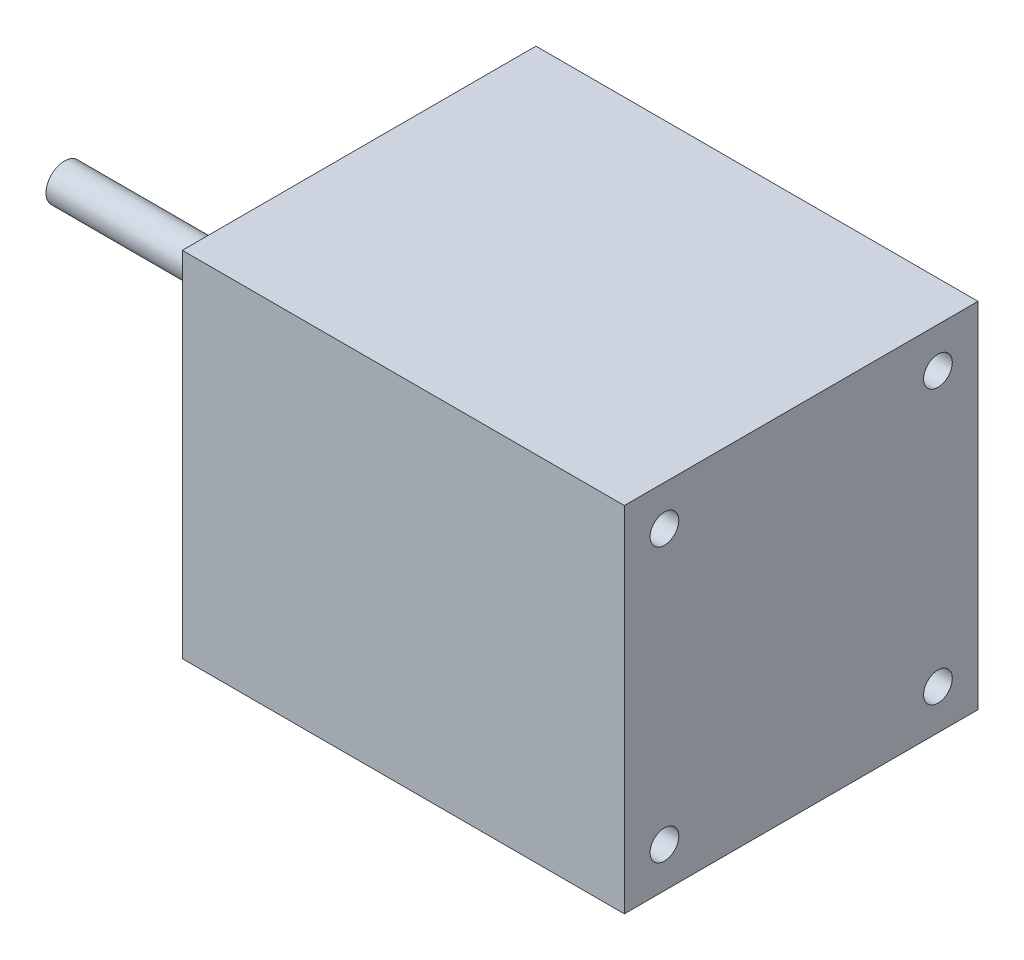
ISO-10303-21;
HEADER;
FILE_DESCRIPTION(('STEP AP214'),'2;1');
FILE_NAME('part.step','',(''),(''),'','','');
FILE_SCHEMA(('AUTOMOTIVE_DESIGN { 1 0 10303 214 1 1 1 1 }'));
ENDSEC;
DATA;
#1=APPLICATION_CONTEXT('core data for automotive mechanical design processes');
#2=APPLICATION_PROTOCOL_DEFINITION('international standard','automotive_design',2000,#1);
#3=PRODUCT_CONTEXT('',#1,'mechanical');
#4=PRODUCT('Part','Part','',(#3));
#5=PRODUCT_RELATED_PRODUCT_CATEGORY('part','',(#4));
#6=PRODUCT_DEFINITION_FORMATION('','',#4);
#7=PRODUCT_DEFINITION_CONTEXT('part definition',#1,'design');
#8=PRODUCT_DEFINITION('design','',#6,#7);
#9=PRODUCT_DEFINITION_SHAPE('','',#8);
#10=(LENGTH_UNIT() NAMED_UNIT(*) SI_UNIT(.MILLI.,.METRE.));
#11=(NAMED_UNIT(*) PLANE_ANGLE_UNIT() SI_UNIT($,.RADIAN.));
#12=(NAMED_UNIT(*) SI_UNIT($,.STERADIAN.) SOLID_ANGLE_UNIT());
#13=UNCERTAINTY_MEASURE_WITH_UNIT(LENGTH_MEASURE(1.E-05),#10,'distance_accuracy_value','');
#14=(GEOMETRIC_REPRESENTATION_CONTEXT(3) GLOBAL_UNCERTAINTY_ASSIGNED_CONTEXT((#13)) GLOBAL_UNIT_ASSIGNED_CONTEXT((#10,
#11,#12)) REPRESENTATION_CONTEXT('',''));
#15=CARTESIAN_POINT('',(0.,0.,0.));
#16=DIRECTION('',(0.,0.,1.));
#17=DIRECTION('',(1.,0.,0.));
#18=AXIS2_PLACEMENT_3D('',#15,#16,#17);
#19=CARTESIAN_POINT('',(76.2,0.,0.));
#20=DIRECTION('',(1.,0.,0.));
#21=DIRECTION('',(0.,0.,-1.));
#22=AXIS2_PLACEMENT_3D('',#19,#20,#21);
#23=PLANE('',#22);
#24=CARTESIAN_POINT('',(76.2,-23.5731723178065,23.5731723178065));
#25=DIRECTION('',(1.,0.,0.));
#26=DIRECTION('',(0.,0.,-1.));
#27=AXIS2_PLACEMENT_3D('',#24,#25,#26);
#28=CIRCLE('',#27,2.4765);
#29=CARTESIAN_POINT('',(76.2,-23.5731723178065,21.0966723178065));
#30=VERTEX_POINT('',#29);
#31=EDGE_CURVE('E231',#30,#30,#28,.T.);
#32=ORIENTED_EDGE('',*,*,#31,.F.);
#33=EDGE_LOOP('',(#32));
#34=FACE_BOUND('',#33,.T.);
#35=CARTESIAN_POINT('',(76.2,23.5731723178065,-23.5731723178065));
#36=DIRECTION('',(1.,0.,0.));
#37=DIRECTION('',(0.,0.,-1.));
#38=AXIS2_PLACEMENT_3D('',#35,#36,#37);
#39=CIRCLE('',#38,2.4765);
#40=CARTESIAN_POINT('',(76.2,23.5731723178065,-26.0496723178065));
#41=VERTEX_POINT('',#40);
#42=EDGE_CURVE('E165',#41,#41,#39,.T.);
#43=ORIENTED_EDGE('',*,*,#42,.F.);
#44=EDGE_LOOP('',(#43));
#45=FACE_BOUND('',#44,.T.);
#46=DIRECTION('',(0.,0.,-1.));
#47=VECTOR('',#46,1.);
#48=CARTESIAN_POINT('',(76.2,-30.48,30.48));
#49=LINE('',#48,#47);
#50=CARTESIAN_POINT('',(76.2,-30.48,30.48));
#51=VERTEX_POINT('',#50);
#52=CARTESIAN_POINT('',(76.2,-30.48,-30.48));
#53=VERTEX_POINT('',#52);
#54=EDGE_CURVE('E147',#51,#53,#49,.T.);
#55=ORIENTED_EDGE('',*,*,#54,.T.);
#56=DIRECTION('',(0.,1.,0.));
#57=VECTOR('',#56,1.);
#58=CARTESIAN_POINT('',(76.2,-30.48,-30.48));
#59=LINE('',#58,#57);
#60=CARTESIAN_POINT('',(76.2,30.48,-30.48));
#61=VERTEX_POINT('',#60);
#62=EDGE_CURVE('E139',#53,#61,#59,.T.);
#63=ORIENTED_EDGE('',*,*,#62,.T.);
#64=DIRECTION('',(0.,0.,-1.));
#65=VECTOR('',#64,1.);
#66=CARTESIAN_POINT('',(76.2,30.48,30.48));
#67=LINE('',#66,#65);
#68=CARTESIAN_POINT('',(76.2,30.48,30.48));
#69=VERTEX_POINT('',#68);
#70=EDGE_CURVE('E146',#69,#61,#67,.T.);
#71=ORIENTED_EDGE('',*,*,#70,.F.);
#72=DIRECTION('',(0.,1.,0.));
#73=VECTOR('',#72,1.);
#74=CARTESIAN_POINT('',(76.2,-30.48,30.48));
#75=LINE('',#74,#73);
#76=EDGE_CURVE('E158',#51,#69,#75,.T.);
#77=ORIENTED_EDGE('',*,*,#76,.F.);
#78=EDGE_LOOP('',(#55,#63,#71,#77));
#79=FACE_BOUND('',#78,.T.);
#80=CARTESIAN_POINT('',(76.2,23.5731723178065,23.5731723178065));
#81=DIRECTION('',(1.,0.,0.));
#82=DIRECTION('',(0.,0.,-1.));
#83=AXIS2_PLACEMENT_3D('',#80,#81,#82);
#84=CIRCLE('',#83,2.4765);
#85=CARTESIAN_POINT('',(76.2,23.5731723178065,21.0966723178065));
#86=VERTEX_POINT('',#85);
#87=EDGE_CURVE('E237',#86,#86,#84,.T.);
#88=ORIENTED_EDGE('',*,*,#87,.F.);
#89=EDGE_LOOP('',(#88));
#90=FACE_BOUND('',#89,.T.);
#91=CARTESIAN_POINT('',(76.2,-23.5731723178065,-23.5731723178065));
#92=DIRECTION('',(1.,0.,0.));
#93=DIRECTION('',(0.,0.,-1.));
#94=AXIS2_PLACEMENT_3D('',#91,#92,#93);
#95=CIRCLE('',#94,2.4765);
#96=CARTESIAN_POINT('',(76.2,-23.5731723178065,-26.0496723178065));
#97=VERTEX_POINT('',#96);
#98=EDGE_CURVE('E225',#97,#97,#95,.T.);
#99=ORIENTED_EDGE('',*,*,#98,.F.);
#100=EDGE_LOOP('',(#99));
#101=FACE_BOUND('',#100,.T.);
#102=ADVANCED_FACE('F96',(#34,#45,#79,#90,#101),#23,.T.);
#103=CARTESIAN_POINT('',(0.,0.,0.));
#104=DIRECTION('',(1.,0.,0.));
#105=DIRECTION('',(0.,0.,-1.));
#106=AXIS2_PLACEMENT_3D('',#103,#104,#105);
#107=PLANE('',#106);
#108=CARTESIAN_POINT('',(0.,0.,0.));
#109=DIRECTION('',(1.,0.,0.));
#110=DIRECTION('',(0.,0.,-1.));
#111=AXIS2_PLACEMENT_3D('',#108,#109,#110);
#112=CIRCLE('',#111,3.175);
#113=CARTESIAN_POINT('',(0.,0.,-3.175));
#114=VERTEX_POINT('',#113);
#115=EDGE_CURVE('E12',#114,#114,#112,.F.);
#116=ORIENTED_EDGE('',*,*,#115,.F.);
#117=EDGE_LOOP('',(#116));
#118=FACE_BOUND('',#117,.T.);
#119=DIRECTION('',(0.,0.,-1.));
#120=VECTOR('',#119,1.);
#121=CARTESIAN_POINT('',(0.,-30.48,30.48));
#122=LINE('',#121,#120);
#123=CARTESIAN_POINT('',(0.,-30.48,30.48));
#124=VERTEX_POINT('',#123);
#125=CARTESIAN_POINT('',(0.,-30.48,-30.48));
#126=VERTEX_POINT('',#125);
#127=EDGE_CURVE('E163',#124,#126,#122,.T.);
#128=ORIENTED_EDGE('',*,*,#127,.F.);
#129=DIRECTION('',(0.,1.,0.));
#130=VECTOR('',#129,1.);
#131=CARTESIAN_POINT('',(0.,-30.48,30.48));
#132=LINE('',#131,#130);
#133=CARTESIAN_POINT('',(0.,30.48,30.48));
#134=VERTEX_POINT('',#133);
#135=EDGE_CURVE('E169',#124,#134,#132,.T.);
#136=ORIENTED_EDGE('',*,*,#135,.T.);
#137=DIRECTION('',(0.,0.,-1.));
#138=VECTOR('',#137,1.);
#139=CARTESIAN_POINT('',(0.,30.48,30.48));
#140=LINE('',#139,#138);
#141=CARTESIAN_POINT('',(0.,30.48,-30.48));
#142=VERTEX_POINT('',#141);
#143=EDGE_CURVE('E167',#134,#142,#140,.T.);
#144=ORIENTED_EDGE('',*,*,#143,.T.);
#145=DIRECTION('',(0.,1.,0.));
#146=VECTOR('',#145,1.);
#147=CARTESIAN_POINT('',(0.,-30.48,-30.48));
#148=LINE('',#147,#146);
#149=EDGE_CURVE('E153',#126,#142,#148,.T.);
#150=ORIENTED_EDGE('',*,*,#149,.F.);
#151=EDGE_LOOP('',(#128,#136,#144,#150));
#152=FACE_BOUND('',#151,.T.);
#153=CARTESIAN_POINT('',(0.,23.5731723178065,-23.5731723178065));
#154=DIRECTION('',(1.,0.,0.));
#155=DIRECTION('',(0.,0.,-1.));
#156=AXIS2_PLACEMENT_3D('',#153,#154,#155);
#157=CIRCLE('',#156,2.4765);
#158=CARTESIAN_POINT('',(0.,23.5731723178065,-26.0496723178065));
#159=VERTEX_POINT('',#158);
#160=EDGE_CURVE('E240',#159,#159,#157,.T.);
#161=ORIENTED_EDGE('',*,*,#160,.T.);
#162=EDGE_LOOP('',(#161));
#163=FACE_BOUND('',#162,.T.);
#164=CARTESIAN_POINT('',(0.,23.5731723178065,23.5731723178065));
#165=DIRECTION('',(1.,0.,0.));
#166=DIRECTION('',(0.,0.,-1.));
#167=AXIS2_PLACEMENT_3D('',#164,#165,#166);
#168=CIRCLE('',#167,2.4765);
#169=CARTESIAN_POINT('',(0.,23.5731723178065,21.0966723178065));
#170=VERTEX_POINT('',#169);
#171=EDGE_CURVE('E234',#170,#170,#168,.T.);
#172=ORIENTED_EDGE('',*,*,#171,.T.);
#173=EDGE_LOOP('',(#172));
#174=FACE_BOUND('',#173,.T.);
#175=CARTESIAN_POINT('',(0.,-23.5731723178065,23.5731723178065));
#176=DIRECTION('',(1.,0.,0.));
#177=DIRECTION('',(0.,0.,-1.));
#178=AXIS2_PLACEMENT_3D('',#175,#176,#177);
#179=CIRCLE('',#178,2.4765);
#180=CARTESIAN_POINT('',(0.,-23.5731723178065,21.0966723178065));
#181=VERTEX_POINT('',#180);
#182=EDGE_CURVE('E229',#181,#181,#179,.T.);
#183=ORIENTED_EDGE('',*,*,#182,.T.);
#184=EDGE_LOOP('',(#183));
#185=FACE_BOUND('',#184,.T.);
#186=CARTESIAN_POINT('',(0.,-23.5731723178065,-23.5731723178065));
#187=DIRECTION('',(1.,0.,0.));
#188=DIRECTION('',(0.,0.,-1.));
#189=AXIS2_PLACEMENT_3D('',#186,#187,#188);
#190=CIRCLE('',#189,2.4765);
#191=CARTESIAN_POINT('',(0.,-23.5731723178065,-26.0496723178065));
#192=VERTEX_POINT('',#191);
#193=EDGE_CURVE('E222',#192,#192,#190,.T.);
#194=ORIENTED_EDGE('',*,*,#193,.T.);
#195=EDGE_LOOP('',(#194));
#196=FACE_BOUND('',#195,.T.);
#197=ADVANCED_FACE('F174',(#118,#152,#163,#174,#185,#196),#107,.F.);
#198=CARTESIAN_POINT('',(76.2,-30.48,30.48));
#199=DIRECTION('',(0.,1.,0.));
#200=DIRECTION('',(0.,0.,1.));
#201=AXIS2_PLACEMENT_3D('',#198,#199,#200);
#202=PLANE('',#201);
#203=ORIENTED_EDGE('',*,*,#127,.T.);
#204=DIRECTION('',(-1.,0.,0.));
#205=VECTOR('',#204,1.);
#206=CARTESIAN_POINT('',(76.2,-30.48,-30.48));
#207=LINE('',#206,#205);
#208=EDGE_CURVE('E105',#53,#126,#207,.T.);
#209=ORIENTED_EDGE('',*,*,#208,.F.);
#210=ORIENTED_EDGE('',*,*,#54,.F.);
#211=DIRECTION('',(-1.,0.,0.));
#212=VECTOR('',#211,1.);
#213=CARTESIAN_POINT('',(76.2,-30.48,30.48));
#214=LINE('',#213,#212);
#215=EDGE_CURVE('E113',#51,#124,#214,.T.);
#216=ORIENTED_EDGE('',*,*,#215,.T.);
#217=EDGE_LOOP('',(#203,#209,#210,#216));
#218=FACE_BOUND('',#217,.T.);
#219=ADVANCED_FACE('F98',(#218),#202,.F.);
#220=CARTESIAN_POINT('',(76.2,-30.48,-30.48));
#221=DIRECTION('',(0.,0.,1.));
#222=DIRECTION('',(1.,0.,0.));
#223=AXIS2_PLACEMENT_3D('',#220,#221,#222);
#224=PLANE('',#223);
#225=ORIENTED_EDGE('',*,*,#149,.T.);
#226=DIRECTION('',(-1.,0.,0.));
#227=VECTOR('',#226,1.);
#228=CARTESIAN_POINT('',(76.2,30.48,-30.48));
#229=LINE('',#228,#227);
#230=EDGE_CURVE('E151',#61,#142,#229,.T.);
#231=ORIENTED_EDGE('',*,*,#230,.F.);
#232=ORIENTED_EDGE('',*,*,#62,.F.);
#233=ORIENTED_EDGE('',*,*,#208,.T.);
#234=EDGE_LOOP('',(#225,#231,#232,#233));
#235=FACE_BOUND('',#234,.T.);
#236=ADVANCED_FACE('F152',(#235),#224,.F.);
#237=CARTESIAN_POINT('',(76.2,30.48,30.48));
#238=DIRECTION('',(0.,1.,0.));
#239=DIRECTION('',(0.,0.,1.));
#240=AXIS2_PLACEMENT_3D('',#237,#238,#239);
#241=PLANE('',#240);
#242=ORIENTED_EDGE('',*,*,#143,.F.);
#243=DIRECTION('',(-1.,0.,0.));
#244=VECTOR('',#243,1.);
#245=CARTESIAN_POINT('',(76.2,30.48,30.48));
#246=LINE('',#245,#244);
#247=EDGE_CURVE('E127',#69,#134,#246,.T.);
#248=ORIENTED_EDGE('',*,*,#247,.F.);
#249=ORIENTED_EDGE('',*,*,#70,.T.);
#250=ORIENTED_EDGE('',*,*,#230,.T.);
#251=EDGE_LOOP('',(#242,#248,#249,#250));
#252=FACE_BOUND('',#251,.T.);
#253=ADVANCED_FACE('F157',(#252),#241,.T.);
#254=CARTESIAN_POINT('',(76.2,-30.48,30.48));
#255=DIRECTION('',(0.,0.,1.));
#256=DIRECTION('',(1.,0.,0.));
#257=AXIS2_PLACEMENT_3D('',#254,#255,#256);
#258=PLANE('',#257);
#259=ORIENTED_EDGE('',*,*,#135,.F.);
#260=ORIENTED_EDGE('',*,*,#215,.F.);
#261=ORIENTED_EDGE('',*,*,#76,.T.);
#262=ORIENTED_EDGE('',*,*,#247,.T.);
#263=EDGE_LOOP('',(#259,#260,#261,#262));
#264=FACE_BOUND('',#263,.T.);
#265=ADVANCED_FACE('F176',(#264),#258,.T.);
#266=CARTESIAN_POINT('',(76.2,23.5731723178065,-23.5731723178065));
#267=DIRECTION('',(-1.,0.,0.));
#268=DIRECTION('',(0.,0.,1.));
#269=AXIS2_PLACEMENT_3D('',#266,#267,#268);
#270=CYLINDRICAL_SURFACE('',#269,2.4765);
#271=ORIENTED_EDGE('',*,*,#42,.T.);
#272=EDGE_LOOP('',(#271));
#273=FACE_BOUND('',#272,.T.);
#274=ORIENTED_EDGE('',*,*,#160,.F.);
#275=EDGE_LOOP('',(#274));
#276=FACE_BOUND('',#275,.T.);
#277=ADVANCED_FACE('F178',(#273,#276),#270,.F.);
#278=CARTESIAN_POINT('',(76.2,23.5731723178065,23.5731723178065));
#279=DIRECTION('',(-1.,0.,0.));
#280=DIRECTION('',(0.,0.,1.));
#281=AXIS2_PLACEMENT_3D('',#278,#279,#280);
#282=CYLINDRICAL_SURFACE('',#281,2.4765);
#283=ORIENTED_EDGE('',*,*,#87,.T.);
#284=EDGE_LOOP('',(#283));
#285=FACE_BOUND('',#284,.T.);
#286=ORIENTED_EDGE('',*,*,#171,.F.);
#287=EDGE_LOOP('',(#286));
#288=FACE_BOUND('',#287,.T.);
#289=ADVANCED_FACE('F184',(#285,#288),#282,.F.);
#290=CARTESIAN_POINT('',(76.2,-23.5731723178065,23.5731723178065));
#291=DIRECTION('',(-1.,0.,0.));
#292=DIRECTION('',(0.,0.,1.));
#293=AXIS2_PLACEMENT_3D('',#290,#291,#292);
#294=CYLINDRICAL_SURFACE('',#293,2.4765);
#295=ORIENTED_EDGE('',*,*,#31,.T.);
#296=EDGE_LOOP('',(#295));
#297=FACE_BOUND('',#296,.T.);
#298=ORIENTED_EDGE('',*,*,#182,.F.);
#299=EDGE_LOOP('',(#298));
#300=FACE_BOUND('',#299,.T.);
#301=ADVANCED_FACE('F201',(#297,#300),#294,.F.);
#302=CARTESIAN_POINT('',(76.2,-23.5731723178065,-23.5731723178065));
#303=DIRECTION('',(-1.,0.,0.));
#304=DIRECTION('',(0.,0.,1.));
#305=AXIS2_PLACEMENT_3D('',#302,#303,#304);
#306=CYLINDRICAL_SURFACE('',#305,2.4765);
#307=ORIENTED_EDGE('',*,*,#98,.T.);
#308=EDGE_LOOP('',(#307));
#309=FACE_BOUND('',#308,.T.);
#310=ORIENTED_EDGE('',*,*,#193,.F.);
#311=EDGE_LOOP('',(#310));
#312=FACE_BOUND('',#311,.T.);
#313=ADVANCED_FACE('F205',(#309,#312),#306,.F.);
#314=CARTESIAN_POINT('',(-50.8,0.,0.));
#315=DIRECTION('',(1.,0.,0.));
#316=DIRECTION('',(0.,0.,-1.));
#317=AXIS2_PLACEMENT_3D('',#314,#315,#316);
#318=CYLINDRICAL_SURFACE('',#317,3.175);
#319=CARTESIAN_POINT('',(-50.8,0.,0.));
#320=DIRECTION('',(-1.,0.,0.));
#321=DIRECTION('',(0.,0.,1.));
#322=AXIS2_PLACEMENT_3D('',#319,#320,#321);
#323=CIRCLE('',#322,3.175);
#324=CARTESIAN_POINT('',(-50.8,0.,3.175));
#325=VERTEX_POINT('',#324);
#326=EDGE_CURVE('E221',#325,#325,#323,.T.);
#327=ORIENTED_EDGE('',*,*,#326,.F.);
#328=EDGE_LOOP('',(#327));
#329=FACE_BOUND('',#328,.T.);
#330=ORIENTED_EDGE('',*,*,#115,.T.);
#331=EDGE_LOOP('',(#330));
#332=FACE_BOUND('',#331,.T.);
#333=ADVANCED_FACE('F209',(#329,#332),#318,.T.);
#334=CARTESIAN_POINT('',(-50.8,0.,0.));
#335=DIRECTION('',(-1.,0.,0.));
#336=DIRECTION('',(0.,0.,1.));
#337=AXIS2_PLACEMENT_3D('',#334,#335,#336);
#338=PLANE('',#337);
#339=ORIENTED_EDGE('',*,*,#326,.T.);
#340=EDGE_LOOP('',(#339));
#341=FACE_BOUND('',#340,.T.);
#342=ADVANCED_FACE('F213',(#341),#338,.T.);
#343=CLOSED_SHELL('',(#102,#197,#219,#236,#253,#265,#277,#289,#301,#313,#333,#342));
#344=MANIFOLD_SOLID_BREP('B2',#343);
#345=ADVANCED_BREP_SHAPE_REPRESENTATION('',(#18,#344),#14);
#346=SHAPE_DEFINITION_REPRESENTATION(#9,#345);
ENDSEC;
END-ISO-10303-21;
